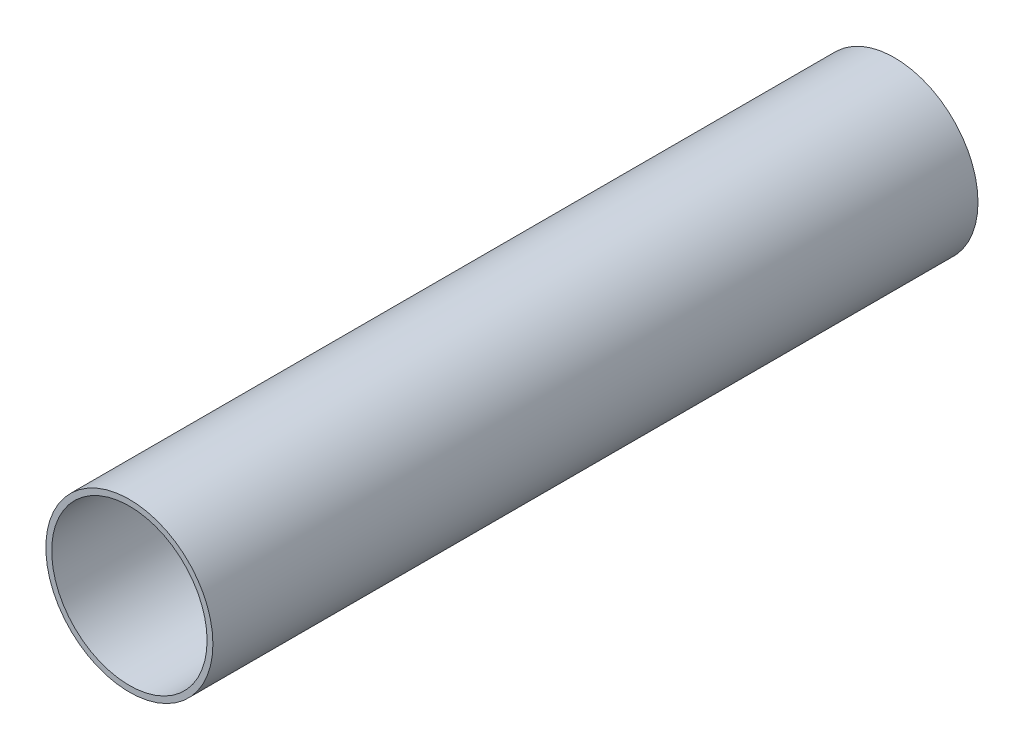
ISO-10303-21;
HEADER;
FILE_DESCRIPTION(('STEP AP214'),'2;1');
FILE_NAME('part.step','',(''),(''),'','','');
FILE_SCHEMA(('AUTOMOTIVE_DESIGN { 1 0 10303 214 1 1 1 1 }'));
ENDSEC;
DATA;
#1=APPLICATION_CONTEXT('core data for automotive mechanical design processes');
#2=APPLICATION_PROTOCOL_DEFINITION('international standard','automotive_design',2000,#1);
#3=PRODUCT_CONTEXT('',#1,'mechanical');
#4=PRODUCT('Part','Part','',(#3));
#5=PRODUCT_RELATED_PRODUCT_CATEGORY('part','',(#4));
#6=PRODUCT_DEFINITION_FORMATION('','',#4);
#7=PRODUCT_DEFINITION_CONTEXT('part definition',#1,'design');
#8=PRODUCT_DEFINITION('design','',#6,#7);
#9=PRODUCT_DEFINITION_SHAPE('','',#8);
#10=(LENGTH_UNIT() NAMED_UNIT(*) SI_UNIT(.MILLI.,.METRE.));
#11=(NAMED_UNIT(*) PLANE_ANGLE_UNIT() SI_UNIT($,.RADIAN.));
#12=(NAMED_UNIT(*) SI_UNIT($,.STERADIAN.) SOLID_ANGLE_UNIT());
#13=UNCERTAINTY_MEASURE_WITH_UNIT(LENGTH_MEASURE(1.E-05),#10,'distance_accuracy_value','');
#14=(GEOMETRIC_REPRESENTATION_CONTEXT(3) GLOBAL_UNCERTAINTY_ASSIGNED_CONTEXT((#13)) GLOBAL_UNIT_ASSIGNED_CONTEXT((#10,
#11,#12)) REPRESENTATION_CONTEXT('',''));
#15=CARTESIAN_POINT('',(0.,0.,0.));
#16=DIRECTION('',(0.,0.,1.));
#17=DIRECTION('',(1.,0.,0.));
#18=AXIS2_PLACEMENT_3D('',#15,#16,#17);
#19=CARTESIAN_POINT('',(0.,0.,203.2));
#20=DIRECTION('',(0.,0.,1.));
#21=DIRECTION('',(1.,0.,0.));
#22=AXIS2_PLACEMENT_3D('',#19,#20,#21);
#23=PLANE('',#22);
#24=CARTESIAN_POINT('',(0.,0.,203.2));
#25=DIRECTION('',(0.,0.,1.));
#26=DIRECTION('',(1.,0.,0.));
#27=AXIS2_PLACEMENT_3D('',#24,#25,#26);
#28=CIRCLE('',#27,22.1869);
#29=CARTESIAN_POINT('',(22.1869,0.,203.2));
#30=VERTEX_POINT('',#29);
#31=EDGE_CURVE('E10',#30,#30,#28,.T.);
#32=ORIENTED_EDGE('',*,*,#31,.T.);
#33=EDGE_LOOP('',(#32));
#34=FACE_BOUND('',#33,.T.);
#35=CARTESIAN_POINT('',(0.,0.,203.2));
#36=DIRECTION('',(0.,0.,1.));
#37=DIRECTION('',(1.,0.,0.));
#38=AXIS2_PLACEMENT_3D('',#35,#36,#37);
#39=CIRCLE('',#38,20.6375);
#40=CARTESIAN_POINT('',(20.6375,0.,203.2));
#41=VERTEX_POINT('',#40);
#42=EDGE_CURVE('E44',#41,#41,#39,.T.);
#43=ORIENTED_EDGE('',*,*,#42,.F.);
#44=EDGE_LOOP('',(#43));
#45=FACE_BOUND('',#44,.T.);
#46=ADVANCED_FACE('F33',(#34,#45),#23,.T.);
#47=CARTESIAN_POINT('',(0.,0.,0.));
#48=DIRECTION('',(0.,0.,1.));
#49=DIRECTION('',(1.,0.,0.));
#50=AXIS2_PLACEMENT_3D('',#47,#48,#49);
#51=PLANE('',#50);
#52=CARTESIAN_POINT('',(0.,0.,0.));
#53=DIRECTION('',(0.,0.,1.));
#54=DIRECTION('',(1.,0.,0.));
#55=AXIS2_PLACEMENT_3D('',#52,#53,#54);
#56=CIRCLE('',#55,22.1869);
#57=CARTESIAN_POINT('',(22.1869,0.,0.));
#58=VERTEX_POINT('',#57);
#59=EDGE_CURVE('E37',#58,#58,#56,.T.);
#60=ORIENTED_EDGE('',*,*,#59,.F.);
#61=EDGE_LOOP('',(#60));
#62=FACE_BOUND('',#61,.T.);
#63=CARTESIAN_POINT('',(0.,0.,0.));
#64=DIRECTION('',(0.,0.,1.));
#65=DIRECTION('',(1.,0.,0.));
#66=AXIS2_PLACEMENT_3D('',#63,#64,#65);
#67=CIRCLE('',#66,20.6375);
#68=CARTESIAN_POINT('',(20.6375,0.,0.));
#69=VERTEX_POINT('',#68);
#70=EDGE_CURVE('E46',#69,#69,#67,.T.);
#71=ORIENTED_EDGE('',*,*,#70,.T.);
#72=EDGE_LOOP('',(#71));
#73=FACE_BOUND('',#72,.T.);
#74=ADVANCED_FACE('F56',(#62,#73),#51,.F.);
#75=CARTESIAN_POINT('',(0.,0.,203.2));
#76=DIRECTION('',(0.,0.,-1.));
#77=DIRECTION('',(-1.,0.,0.));
#78=AXIS2_PLACEMENT_3D('',#75,#76,#77);
#79=CYLINDRICAL_SURFACE('',#78,22.1869);
#80=ORIENTED_EDGE('',*,*,#31,.F.);
#81=EDGE_LOOP('',(#80));
#82=FACE_BOUND('',#81,.T.);
#83=ORIENTED_EDGE('',*,*,#59,.T.);
#84=EDGE_LOOP('',(#83));
#85=FACE_BOUND('',#84,.T.);
#86=ADVANCED_FACE('F35',(#82,#85),#79,.T.);
#87=CARTESIAN_POINT('',(0.,0.,203.2));
#88=DIRECTION('',(0.,0.,-1.));
#89=DIRECTION('',(-1.,0.,0.));
#90=AXIS2_PLACEMENT_3D('',#87,#88,#89);
#91=CYLINDRICAL_SURFACE('',#90,20.6375);
#92=ORIENTED_EDGE('',*,*,#42,.T.);
#93=EDGE_LOOP('',(#92));
#94=FACE_BOUND('',#93,.T.);
#95=ORIENTED_EDGE('',*,*,#70,.F.);
#96=EDGE_LOOP('',(#95));
#97=FACE_BOUND('',#96,.T.);
#98=ADVANCED_FACE('F52',(#94,#97),#91,.F.);
#99=CLOSED_SHELL('',(#46,#74,#86,#98));
#100=MANIFOLD_SOLID_BREP('B2',#99);
#101=ADVANCED_BREP_SHAPE_REPRESENTATION('',(#18,#100),#14);
#102=SHAPE_DEFINITION_REPRESENTATION(#9,#101);
ENDSEC;
END-ISO-10303-21;
